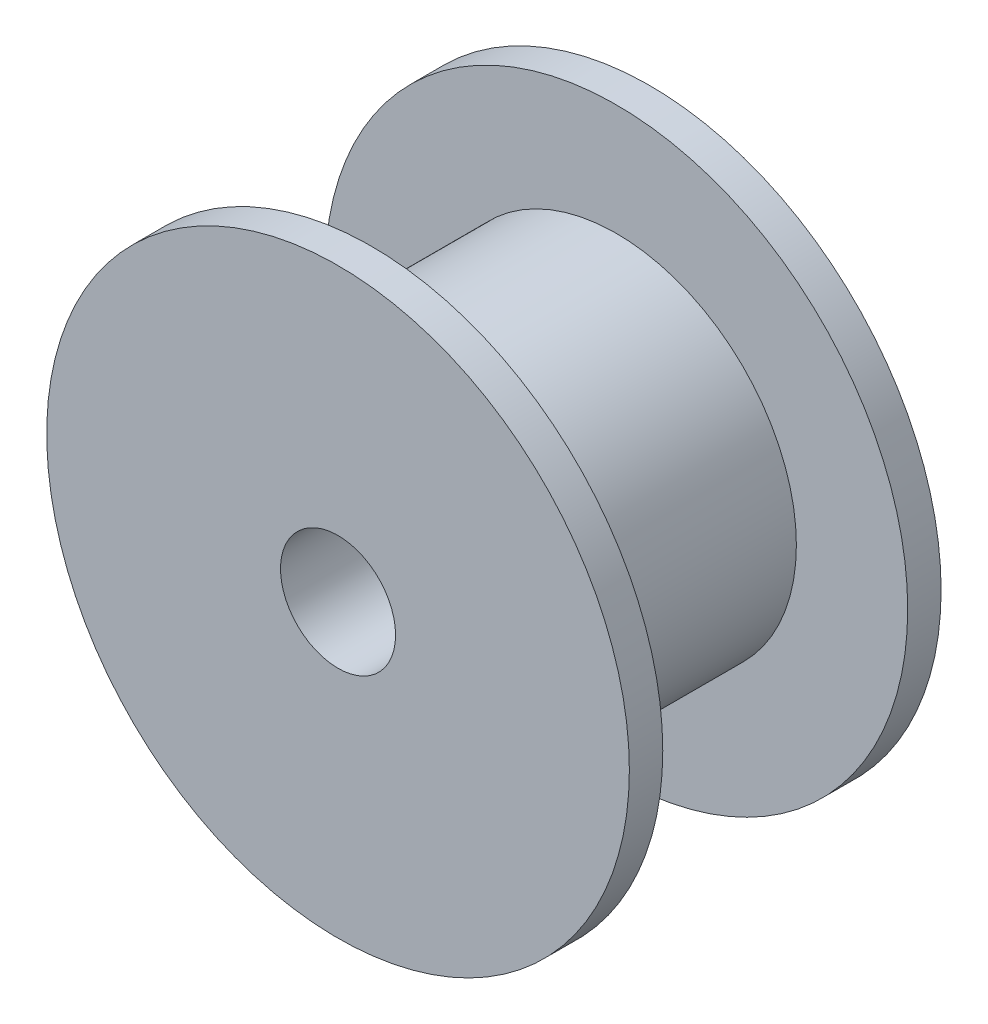
ISO-10303-21;
HEADER;
FILE_DESCRIPTION(('STEP AP214'),'2;1');
FILE_NAME('part.step','',(''),(''),'','','');
FILE_SCHEMA(('AUTOMOTIVE_DESIGN { 1 0 10303 214 1 1 1 1 }'));
ENDSEC;
DATA;
#1=APPLICATION_CONTEXT('core data for automotive mechanical design processes');
#2=APPLICATION_PROTOCOL_DEFINITION('international standard','automotive_design',2000,#1);
#3=PRODUCT_CONTEXT('',#1,'mechanical');
#4=PRODUCT('Part','Part','',(#3));
#5=PRODUCT_RELATED_PRODUCT_CATEGORY('part','',(#4));
#6=PRODUCT_DEFINITION_FORMATION('','',#4);
#7=PRODUCT_DEFINITION_CONTEXT('part definition',#1,'design');
#8=PRODUCT_DEFINITION('design','',#6,#7);
#9=PRODUCT_DEFINITION_SHAPE('','',#8);
#10=(LENGTH_UNIT() NAMED_UNIT(*) SI_UNIT(.MILLI.,.METRE.));
#11=(NAMED_UNIT(*) PLANE_ANGLE_UNIT() SI_UNIT($,.RADIAN.));
#12=(NAMED_UNIT(*) SI_UNIT($,.STERADIAN.) SOLID_ANGLE_UNIT());
#13=UNCERTAINTY_MEASURE_WITH_UNIT(LENGTH_MEASURE(1.E-05),#10,'distance_accuracy_value','');
#14=(GEOMETRIC_REPRESENTATION_CONTEXT(3) GLOBAL_UNCERTAINTY_ASSIGNED_CONTEXT((#13)) GLOBAL_UNIT_ASSIGNED_CONTEXT((#10,
#11,#12)) REPRESENTATION_CONTEXT('',''));
#15=CARTESIAN_POINT('',(0.,0.,0.));
#16=DIRECTION('',(0.,0.,1.));
#17=DIRECTION('',(1.,0.,0.));
#18=AXIS2_PLACEMENT_3D('',#15,#16,#17);
#19=CARTESIAN_POINT('',(0.,0.,4.2));
#20=DIRECTION('',(0.,0.,-1.));
#21=DIRECTION('',(-1.,0.,0.));
#22=AXIS2_PLACEMENT_3D('',#19,#20,#21);
#23=CYLINDRICAL_SURFACE('',#22,4.84999999999999);
#24=CARTESIAN_POINT('',(0.,0.,-3.3));
#25=DIRECTION('',(0.,0.,1.));
#26=DIRECTION('',(1.,0.,0.));
#27=AXIS2_PLACEMENT_3D('',#24,#25,#26);
#28=CIRCLE('',#27,4.84999999999999);
#29=CARTESIAN_POINT('',(4.84999999999999,0.,-3.3));
#30=VERTEX_POINT('',#29);
#31=EDGE_CURVE('E86',#30,#30,#28,.T.);
#32=ORIENTED_EDGE('',*,*,#31,.T.);
#33=EDGE_LOOP('',(#32));
#34=FACE_BOUND('',#33,.T.);
#35=CARTESIAN_POINT('',(0.,0.,3.3));
#36=DIRECTION('',(0.,0.,1.));
#37=DIRECTION('',(1.,0.,0.));
#38=AXIS2_PLACEMENT_3D('',#35,#36,#37);
#39=CIRCLE('',#38,4.84999999999999);
#40=CARTESIAN_POINT('',(4.84999999999999,0.,3.3));
#41=VERTEX_POINT('',#40);
#42=EDGE_CURVE('E11',#41,#41,#39,.T.);
#43=ORIENTED_EDGE('',*,*,#42,.F.);
#44=EDGE_LOOP('',(#43));
#45=FACE_BOUND('',#44,.T.);
#46=ADVANCED_FACE('F52',(#34,#45),#23,.T.);
#47=CARTESIAN_POINT('',(0.,0.,4.2));
#48=DIRECTION('',(0.,0.,-1.));
#49=DIRECTION('',(-1.,0.,0.));
#50=AXIS2_PLACEMENT_3D('',#47,#48,#49);
#51=CYLINDRICAL_SURFACE('',#50,1.55);
#52=CARTESIAN_POINT('',(0.,0.,4.2));
#53=DIRECTION('',(0.,0.,1.));
#54=DIRECTION('',(1.,0.,0.));
#55=AXIS2_PLACEMENT_3D('',#52,#53,#54);
#56=CIRCLE('',#55,1.55);
#57=CARTESIAN_POINT('',(1.55,0.,4.2));
#58=VERTEX_POINT('',#57);
#59=EDGE_CURVE('E60',#58,#58,#56,.T.);
#60=ORIENTED_EDGE('',*,*,#59,.T.);
#61=EDGE_LOOP('',(#60));
#62=FACE_BOUND('',#61,.T.);
#63=CARTESIAN_POINT('',(0.,0.,-4.2));
#64=DIRECTION('',(0.,0.,1.));
#65=DIRECTION('',(1.,0.,0.));
#66=AXIS2_PLACEMENT_3D('',#63,#64,#65);
#67=CIRCLE('',#66,1.55);
#68=CARTESIAN_POINT('',(1.55,0.,-4.2));
#69=VERTEX_POINT('',#68);
#70=EDGE_CURVE('E66',#69,#69,#67,.T.);
#71=ORIENTED_EDGE('',*,*,#70,.F.);
#72=EDGE_LOOP('',(#71));
#73=FACE_BOUND('',#72,.T.);
#74=ADVANCED_FACE('F54',(#62,#73),#51,.F.);
#75=CARTESIAN_POINT('',(0.,0.,4.2));
#76=DIRECTION('',(0.,0.,1.));
#77=DIRECTION('',(1.,0.,0.));
#78=AXIS2_PLACEMENT_3D('',#75,#76,#77);
#79=PLANE('',#78);
#80=ORIENTED_EDGE('',*,*,#59,.F.);
#81=EDGE_LOOP('',(#80));
#82=FACE_BOUND('',#81,.T.);
#83=CARTESIAN_POINT('',(0.,0.,4.2));
#84=DIRECTION('',(0.,0.,1.));
#85=DIRECTION('',(1.,0.,0.));
#86=AXIS2_PLACEMENT_3D('',#83,#84,#85);
#87=CIRCLE('',#86,7.85);
#88=CARTESIAN_POINT('',(7.85,0.,4.2));
#89=VERTEX_POINT('',#88);
#90=EDGE_CURVE('E75',#89,#89,#87,.T.);
#91=ORIENTED_EDGE('',*,*,#90,.T.);
#92=EDGE_LOOP('',(#91));
#93=FACE_BOUND('',#92,.T.);
#94=ADVANCED_FACE('F113',(#82,#93),#79,.T.);
#95=CARTESIAN_POINT('',(0.,0.,-4.2));
#96=DIRECTION('',(0.,0.,1.));
#97=DIRECTION('',(1.,0.,0.));
#98=AXIS2_PLACEMENT_3D('',#95,#96,#97);
#99=PLANE('',#98);
#100=ORIENTED_EDGE('',*,*,#70,.T.);
#101=EDGE_LOOP('',(#100));
#102=FACE_BOUND('',#101,.T.);
#103=CARTESIAN_POINT('',(0.,0.,-4.2));
#104=DIRECTION('',(0.,0.,1.));
#105=DIRECTION('',(1.,0.,0.));
#106=AXIS2_PLACEMENT_3D('',#103,#104,#105);
#107=CIRCLE('',#106,7.85);
#108=CARTESIAN_POINT('',(7.85,0.,-4.2));
#109=VERTEX_POINT('',#108);
#110=EDGE_CURVE('E82',#109,#109,#107,.T.);
#111=ORIENTED_EDGE('',*,*,#110,.F.);
#112=EDGE_LOOP('',(#111));
#113=FACE_BOUND('',#112,.T.);
#114=ADVANCED_FACE('F115',(#102,#113),#99,.F.);
#115=CARTESIAN_POINT('',(0.,0.,3.3));
#116=DIRECTION('',(0.,0.,1.));
#117=DIRECTION('',(1.,0.,0.));
#118=AXIS2_PLACEMENT_3D('',#115,#116,#117);
#119=CYLINDRICAL_SURFACE('',#118,7.85);
#120=CARTESIAN_POINT('',(0.,0.,3.3));
#121=DIRECTION('',(0.,0.,1.));
#122=DIRECTION('',(1.,0.,0.));
#123=AXIS2_PLACEMENT_3D('',#120,#121,#122);
#124=CIRCLE('',#123,7.85);
#125=CARTESIAN_POINT('',(7.85,0.,3.3));
#126=VERTEX_POINT('',#125);
#127=EDGE_CURVE('E73',#126,#126,#124,.T.);
#128=ORIENTED_EDGE('',*,*,#127,.T.);
#129=EDGE_LOOP('',(#128));
#130=FACE_BOUND('',#129,.T.);
#131=ORIENTED_EDGE('',*,*,#90,.F.);
#132=EDGE_LOOP('',(#131));
#133=FACE_BOUND('',#132,.T.);
#134=ADVANCED_FACE('F107',(#130,#133),#119,.T.);
#135=CARTESIAN_POINT('',(0.,0.,3.3));
#136=DIRECTION('',(0.,0.,1.));
#137=DIRECTION('',(1.,0.,0.));
#138=AXIS2_PLACEMENT_3D('',#135,#136,#137);
#139=PLANE('',#138);
#140=ORIENTED_EDGE('',*,*,#42,.T.);
#141=EDGE_LOOP('',(#140));
#142=FACE_BOUND('',#141,.T.);
#143=ORIENTED_EDGE('',*,*,#127,.F.);
#144=EDGE_LOOP('',(#143));
#145=FACE_BOUND('',#144,.T.);
#146=ADVANCED_FACE('F98',(#142,#145),#139,.F.);
#147=CARTESIAN_POINT('',(0.,0.,-3.3));
#148=DIRECTION('',(0.,0.,1.));
#149=DIRECTION('',(1.,0.,0.));
#150=AXIS2_PLACEMENT_3D('',#147,#148,#149);
#151=PLANE('',#150);
#152=CARTESIAN_POINT('',(0.,0.,-3.3));
#153=DIRECTION('',(0.,0.,1.));
#154=DIRECTION('',(1.,0.,0.));
#155=AXIS2_PLACEMENT_3D('',#152,#153,#154);
#156=CIRCLE('',#155,7.85);
#157=CARTESIAN_POINT('',(7.85,0.,-3.3));
#158=VERTEX_POINT('',#157);
#159=EDGE_CURVE('E79',#158,#158,#156,.T.);
#160=ORIENTED_EDGE('',*,*,#159,.T.);
#161=EDGE_LOOP('',(#160));
#162=FACE_BOUND('',#161,.T.);
#163=ORIENTED_EDGE('',*,*,#31,.F.);
#164=EDGE_LOOP('',(#163));
#165=FACE_BOUND('',#164,.T.);
#166=ADVANCED_FACE('F95',(#162,#165),#151,.T.);
#167=CARTESIAN_POINT('',(0.,0.,-3.3));
#168=DIRECTION('',(0.,0.,-1.));
#169=DIRECTION('',(-1.,0.,0.));
#170=AXIS2_PLACEMENT_3D('',#167,#168,#169);
#171=CYLINDRICAL_SURFACE('',#170,7.85);
#172=ORIENTED_EDGE('',*,*,#159,.F.);
#173=EDGE_LOOP('',(#172));
#174=FACE_BOUND('',#173,.T.);
#175=ORIENTED_EDGE('',*,*,#110,.T.);
#176=EDGE_LOOP('',(#175));
#177=FACE_BOUND('',#176,.T.);
#178=ADVANCED_FACE('F97',(#174,#177),#171,.T.);
#179=CLOSED_SHELL('',(#46,#74,#94,#114,#134,#146,#166,#178));
#180=MANIFOLD_SOLID_BREP('B2',#179);
#181=ADVANCED_BREP_SHAPE_REPRESENTATION('',(#18,#180),#14);
#182=SHAPE_DEFINITION_REPRESENTATION(#9,#181);
ENDSEC;
END-ISO-10303-21;
